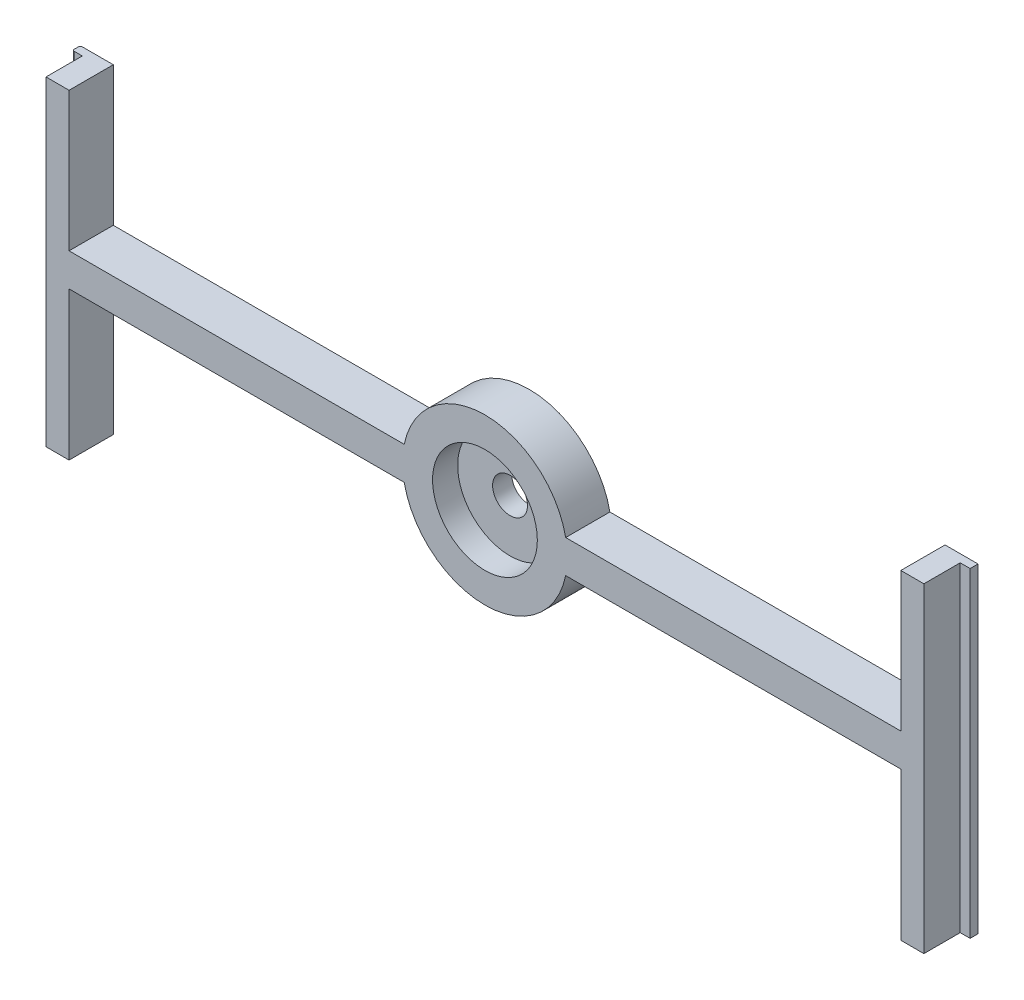
ISO-10303-21;
HEADER;
FILE_DESCRIPTION(('STEP AP214'),'2;1');
FILE_NAME('part.step','',(''),(''),'','','');
FILE_SCHEMA(('AUTOMOTIVE_DESIGN { 1 0 10303 214 1 1 1 1 }'));
ENDSEC;
DATA;
#1=APPLICATION_CONTEXT('core data for automotive mechanical design processes');
#2=APPLICATION_PROTOCOL_DEFINITION('international standard','automotive_design',2000,#1);
#3=PRODUCT_CONTEXT('',#1,'mechanical');
#4=PRODUCT('Part','Part','',(#3));
#5=PRODUCT_RELATED_PRODUCT_CATEGORY('part','',(#4));
#6=PRODUCT_DEFINITION_FORMATION('','',#4);
#7=PRODUCT_DEFINITION_CONTEXT('part definition',#1,'design');
#8=PRODUCT_DEFINITION('design','',#6,#7);
#9=PRODUCT_DEFINITION_SHAPE('','',#8);
#10=(LENGTH_UNIT() NAMED_UNIT(*) SI_UNIT(.MILLI.,.METRE.));
#11=(NAMED_UNIT(*) PLANE_ANGLE_UNIT() SI_UNIT($,.RADIAN.));
#12=(NAMED_UNIT(*) SI_UNIT($,.STERADIAN.) SOLID_ANGLE_UNIT());
#13=UNCERTAINTY_MEASURE_WITH_UNIT(LENGTH_MEASURE(1.E-05),#10,'distance_accuracy_value','');
#14=(GEOMETRIC_REPRESENTATION_CONTEXT(3) GLOBAL_UNCERTAINTY_ASSIGNED_CONTEXT((#13)) GLOBAL_UNIT_ASSIGNED_CONTEXT((#10,
#11,#12)) REPRESENTATION_CONTEXT('',''));
#15=CARTESIAN_POINT('',(0.,0.,0.));
#16=DIRECTION('',(0.,0.,1.));
#17=DIRECTION('',(1.,0.,0.));
#18=AXIS2_PLACEMENT_3D('',#15,#16,#17);
#19=CARTESIAN_POINT('',(-63.1,25.,6.71));
#20=DIRECTION('',(-1.,0.,0.));
#21=DIRECTION('',(0.,-1.,0.));
#22=AXIS2_PLACEMENT_3D('',#19,#20,#21);
#23=PLANE('',#22);
#24=DIRECTION('',(0.,1.,0.));
#25=VECTOR('',#24,1.);
#26=CARTESIAN_POINT('',(-63.1,25.,0.));
#27=LINE('',#26,#25);
#28=CARTESIAN_POINT('',(-63.1,2.50000000000002,0.));
#29=VERTEX_POINT('',#28);
#30=CARTESIAN_POINT('',(-63.1,23.6,0.));
#31=VERTEX_POINT('',#30);
#32=EDGE_CURVE('E326',#29,#31,#27,.T.);
#33=ORIENTED_EDGE('',*,*,#32,.T.);
#34=DIRECTION('',(0.,0.,1.));
#35=VECTOR('',#34,1.);
#36=CARTESIAN_POINT('',(-63.1,23.6,6.71));
#37=LINE('',#36,#35);
#38=CARTESIAN_POINT('',(-63.1,23.6,6.71));
#39=VERTEX_POINT('',#38);
#40=EDGE_CURVE('E395',#31,#39,#37,.T.);
#41=ORIENTED_EDGE('',*,*,#40,.T.);
#42=DIRECTION('',(0.,1.,0.));
#43=VECTOR('',#42,1.);
#44=CARTESIAN_POINT('',(-63.1,25.,6.71));
#45=LINE('',#44,#43);
#46=CARTESIAN_POINT('',(-63.1,2.50000000000002,6.71));
#47=VERTEX_POINT('',#46);
#48=EDGE_CURVE('E238',#47,#39,#45,.T.);
#49=ORIENTED_EDGE('',*,*,#48,.F.);
#50=DIRECTION('',(0.,0.,-1.));
#51=VECTOR('',#50,1.);
#52=CARTESIAN_POINT('',(-63.1,2.50000000000002,6.71));
#53=LINE('',#52,#51);
#54=EDGE_CURVE('E239',#47,#29,#53,.T.);
#55=ORIENTED_EDGE('',*,*,#54,.T.);
#56=EDGE_LOOP('',(#33,#41,#49,#55));
#57=FACE_BOUND('',#56,.T.);
#58=ADVANCED_FACE('F39',(#57),#23,.F.);
#59=CARTESIAN_POINT('',(-68.1,25.,6.71));
#60=DIRECTION('',(1.,0.,0.));
#61=DIRECTION('',(0.,0.,-1.));
#62=AXIS2_PLACEMENT_3D('',#59,#60,#61);
#63=PLANE('',#62);
#64=DIRECTION('',(0.,0.,1.));
#65=VECTOR('',#64,1.);
#66=CARTESIAN_POINT('',(-68.1,23.6,0.));
#67=LINE('',#66,#65);
#68=CARTESIAN_POINT('',(-68.1,23.6,0.3));
#69=VERTEX_POINT('',#68);
#70=CARTESIAN_POINT('',(-68.1,23.6,0.899999999999983));
#71=VERTEX_POINT('',#70);
#72=EDGE_CURVE('E202',#69,#71,#67,.T.);
#73=ORIENTED_EDGE('',*,*,#72,.F.);
#74=DIRECTION('',(0.,-1.,0.));
#75=VECTOR('',#74,1.);
#76=CARTESIAN_POINT('',(-68.1,25.,0.3));
#77=LINE('',#76,#75);
#78=CARTESIAN_POINT('',(-68.1,-25.,0.3));
#79=VERTEX_POINT('',#78);
#80=EDGE_CURVE('E291',#69,#79,#77,.T.);
#81=ORIENTED_EDGE('',*,*,#80,.T.);
#82=DIRECTION('',(0.,0.,-1.));
#83=VECTOR('',#82,1.);
#84=CARTESIAN_POINT('',(-68.1,-25.,6.71));
#85=LINE('',#84,#83);
#86=CARTESIAN_POINT('',(-68.1,-25.,0.899999999999983));
#87=VERTEX_POINT('',#86);
#88=EDGE_CURVE('E282',#87,#79,#85,.T.);
#89=ORIENTED_EDGE('',*,*,#88,.F.);
#90=DIRECTION('',(0.,-1.,0.));
#91=VECTOR('',#90,1.);
#92=CARTESIAN_POINT('',(-68.1,25.,0.899999999999983));
#93=LINE('',#92,#91);
#94=EDGE_CURVE('E288',#87,#71,#93,.F.);
#95=ORIENTED_EDGE('',*,*,#94,.T.);
#96=EDGE_LOOP('',(#73,#81,#89,#95));
#97=FACE_BOUND('',#96,.T.);
#98=ADVANCED_FACE('F312',(#97),#63,.F.);
#99=CARTESIAN_POINT('',(-63.1,-25.,6.71));
#100=DIRECTION('',(0.,1.,0.));
#101=DIRECTION('',(-1.,0.,0.));
#102=AXIS2_PLACEMENT_3D('',#99,#100,#101);
#103=PLANE('',#102);
#104=ORIENTED_EDGE('',*,*,#88,.T.);
#105=CARTESIAN_POINT('',(-67.8,-25.,0.3));
#106=DIRECTION('',(0.,1.,0.));
#107=DIRECTION('',(-1.,0.,0.));
#108=AXIS2_PLACEMENT_3D('',#105,#106,#107);
#109=CIRCLE('',#108,0.3);
#110=CARTESIAN_POINT('',(-67.8,-25.,0.));
#111=VERTEX_POINT('',#110);
#112=EDGE_CURVE('E298',#79,#111,#109,.F.);
#113=ORIENTED_EDGE('',*,*,#112,.T.);
#114=DIRECTION('',(1.,0.,0.));
#115=VECTOR('',#114,1.);
#116=CARTESIAN_POINT('',(-63.1,-25.,0.));
#117=LINE('',#116,#115);
#118=CARTESIAN_POINT('',(-63.1,-25.,0.));
#119=VERTEX_POINT('',#118);
#120=EDGE_CURVE('E321',#111,#119,#117,.T.);
#121=ORIENTED_EDGE('',*,*,#120,.T.);
#122=DIRECTION('',(0.,0.,-1.));
#123=VECTOR('',#122,1.);
#124=CARTESIAN_POINT('',(-63.1,-25.,6.71));
#125=LINE('',#124,#123);
#126=CARTESIAN_POINT('',(-63.1,-25.,6.71));
#127=VERTEX_POINT('',#126);
#128=EDGE_CURVE('E278',#127,#119,#125,.T.);
#129=ORIENTED_EDGE('',*,*,#128,.F.);
#130=DIRECTION('',(1.,0.,0.));
#131=VECTOR('',#130,1.);
#132=CARTESIAN_POINT('',(-63.1,-25.,6.71));
#133=LINE('',#132,#131);
#134=CARTESIAN_POINT('',(-66.6,-25.,6.71));
#135=VERTEX_POINT('',#134);
#136=EDGE_CURVE('E397',#135,#127,#133,.T.);
#137=ORIENTED_EDGE('',*,*,#136,.F.);
#138=DIRECTION('',(0.,0.,1.));
#139=VECTOR('',#138,1.);
#140=CARTESIAN_POINT('',(-66.6,-25.,6.70999999999998));
#141=LINE('',#140,#139);
#142=CARTESIAN_POINT('',(-66.6,-25.,1.19999999999998));
#143=VERTEX_POINT('',#142);
#144=EDGE_CURVE('E434',#143,#135,#141,.T.);
#145=ORIENTED_EDGE('',*,*,#144,.F.);
#146=DIRECTION('',(1.,0.,0.));
#147=VECTOR('',#146,1.);
#148=CARTESIAN_POINT('',(-66.6,-25.,1.19999999999998));
#149=LINE('',#148,#147);
#150=CARTESIAN_POINT('',(-67.8,-25.,1.19999999999998));
#151=VERTEX_POINT('',#150);
#152=EDGE_CURVE('E444',#151,#143,#149,.T.);
#153=ORIENTED_EDGE('',*,*,#152,.F.);
#154=CARTESIAN_POINT('',(-67.8,-25.,0.899999999999983));
#155=DIRECTION('',(0.,1.,0.));
#156=DIRECTION('',(-1.,0.,0.));
#157=AXIS2_PLACEMENT_3D('',#154,#155,#156);
#158=CIRCLE('',#157,0.3);
#159=EDGE_CURVE('E295',#151,#87,#158,.F.);
#160=ORIENTED_EDGE('',*,*,#159,.T.);
#161=EDGE_LOOP('',(#104,#113,#121,#129,#137,#145,#153,#160));
#162=FACE_BOUND('',#161,.T.);
#163=ADVANCED_FACE('F319',(#162),#103,.F.);
#164=CARTESIAN_POINT('',(-63.1,-2.50000000000002,6.71));
#165=DIRECTION('',(-1.,0.,0.));
#166=DIRECTION('',(0.,-1.,0.));
#167=AXIS2_PLACEMENT_3D('',#164,#165,#166);
#168=PLANE('',#167);
#169=DIRECTION('',(0.,1.,0.));
#170=VECTOR('',#169,1.);
#171=CARTESIAN_POINT('',(-63.1,-2.50000000000002,0.));
#172=LINE('',#171,#170);
#173=CARTESIAN_POINT('',(-63.1,-2.50000000000002,0.));
#174=VERTEX_POINT('',#173);
#175=EDGE_CURVE('E324',#119,#174,#172,.T.);
#176=ORIENTED_EDGE('',*,*,#175,.T.);
#177=DIRECTION('',(0.,0.,-1.));
#178=VECTOR('',#177,1.);
#179=CARTESIAN_POINT('',(-63.1,-2.50000000000002,6.71));
#180=LINE('',#179,#178);
#181=CARTESIAN_POINT('',(-63.1,-2.50000000000002,6.71));
#182=VERTEX_POINT('',#181);
#183=EDGE_CURVE('E274',#182,#174,#180,.T.);
#184=ORIENTED_EDGE('',*,*,#183,.F.);
#185=DIRECTION('',(0.,1.,0.));
#186=VECTOR('',#185,1.);
#187=CARTESIAN_POINT('',(-63.1,-2.50000000000002,6.71));
#188=LINE('',#187,#186);
#189=EDGE_CURVE('E400',#127,#182,#188,.T.);
#190=ORIENTED_EDGE('',*,*,#189,.F.);
#191=ORIENTED_EDGE('',*,*,#128,.T.);
#192=EDGE_LOOP('',(#176,#184,#190,#191));
#193=FACE_BOUND('',#192,.T.);
#194=ADVANCED_FACE('F429',(#193),#168,.F.);
#195=CARTESIAN_POINT('',(-63.1,-2.50000000000002,6.71));
#196=DIRECTION('',(0.,1.,0.));
#197=DIRECTION('',(-1.,0.,0.));
#198=AXIS2_PLACEMENT_3D('',#195,#196,#197);
#199=PLANE('',#198);
#200=DIRECTION('',(1.,0.,0.));
#201=VECTOR('',#200,1.);
#202=CARTESIAN_POINT('',(-63.1,-2.50000000000002,0.));
#203=LINE('',#202,#201);
#204=CARTESIAN_POINT('',(-12.2474487139159,-2.50000000000002,0.));
#205=VERTEX_POINT('',#204);
#206=EDGE_CURVE('E330',#174,#205,#203,.T.);
#207=ORIENTED_EDGE('',*,*,#206,.T.);
#208=DIRECTION('',(0.,0.,-1.));
#209=VECTOR('',#208,1.);
#210=CARTESIAN_POINT('',(-12.2474487139159,-2.50000000000002,6.71));
#211=LINE('',#210,#209);
#212=CARTESIAN_POINT('',(-12.2474487139159,-2.50000000000002,6.71));
#213=VERTEX_POINT('',#212);
#214=EDGE_CURVE('E270',#213,#205,#211,.T.);
#215=ORIENTED_EDGE('',*,*,#214,.F.);
#216=DIRECTION('',(1.,0.,0.));
#217=VECTOR('',#216,1.);
#218=CARTESIAN_POINT('',(-63.1,-2.50000000000002,6.71));
#219=LINE('',#218,#217);
#220=EDGE_CURVE('E408',#182,#213,#219,.T.);
#221=ORIENTED_EDGE('',*,*,#220,.F.);
#222=ORIENTED_EDGE('',*,*,#183,.T.);
#223=EDGE_LOOP('',(#207,#215,#221,#222));
#224=FACE_BOUND('',#223,.T.);
#225=ADVANCED_FACE('F425',(#224),#199,.F.);
#226=CARTESIAN_POINT('',(0.,0.,6.71));
#227=DIRECTION('',(0.,0.,-1.));
#228=DIRECTION('',(-1.,0.,0.));
#229=AXIS2_PLACEMENT_3D('',#226,#227,#228);
#230=CYLINDRICAL_SURFACE('',#229,12.5);
#231=CARTESIAN_POINT('',(0.,0.,0.));
#232=DIRECTION('',(0.,0.,1.));
#233=DIRECTION('',(1.,0.,0.));
#234=AXIS2_PLACEMENT_3D('',#231,#232,#233);
#235=CIRCLE('',#234,12.5);
#236=CARTESIAN_POINT('',(12.2474487139159,-2.50000000000002,0.));
#237=VERTEX_POINT('',#236);
#238=EDGE_CURVE('E339',#205,#237,#235,.T.);
#239=ORIENTED_EDGE('',*,*,#238,.T.);
#240=DIRECTION('',(0.,0.,-1.));
#241=VECTOR('',#240,1.);
#242=CARTESIAN_POINT('',(12.2474487139159,-2.50000000000002,6.71));
#243=LINE('',#242,#241);
#244=CARTESIAN_POINT('',(12.2474487139159,-2.50000000000002,6.71));
#245=VERTEX_POINT('',#244);
#246=EDGE_CURVE('E266',#245,#237,#243,.T.);
#247=ORIENTED_EDGE('',*,*,#246,.F.);
#248=CARTESIAN_POINT('',(0.,0.,6.71));
#249=DIRECTION('',(0.,0.,1.));
#250=DIRECTION('',(1.,0.,0.));
#251=AXIS2_PLACEMENT_3D('',#248,#249,#250);
#252=CIRCLE('',#251,12.5);
#253=EDGE_CURVE('E411',#213,#245,#252,.T.);
#254=ORIENTED_EDGE('',*,*,#253,.F.);
#255=ORIENTED_EDGE('',*,*,#214,.T.);
#256=EDGE_LOOP('',(#239,#247,#254,#255));
#257=FACE_BOUND('',#256,.T.);
#258=ADVANCED_FACE('F421',(#257),#230,.T.);
#259=CARTESIAN_POINT('',(12.2474487139159,-2.50000000000002,6.71));
#260=DIRECTION('',(0.,1.,0.));
#261=DIRECTION('',(-1.,0.,0.));
#262=AXIS2_PLACEMENT_3D('',#259,#260,#261);
#263=PLANE('',#262);
#264=DIRECTION('',(1.,0.,0.));
#265=VECTOR('',#264,1.);
#266=CARTESIAN_POINT('',(12.2474487139159,-2.50000000000002,0.));
#267=LINE('',#266,#265);
#268=CARTESIAN_POINT('',(63.1,-2.5,0.));
#269=VERTEX_POINT('',#268);
#270=EDGE_CURVE('E342',#237,#269,#267,.T.);
#271=ORIENTED_EDGE('',*,*,#270,.T.);
#272=DIRECTION('',(0.,0.,-1.));
#273=VECTOR('',#272,1.);
#274=CARTESIAN_POINT('',(63.1,-2.5,6.71));
#275=LINE('',#274,#273);
#276=CARTESIAN_POINT('',(63.1,-2.5,6.71));
#277=VERTEX_POINT('',#276);
#278=EDGE_CURVE('E262',#277,#269,#275,.T.);
#279=ORIENTED_EDGE('',*,*,#278,.F.);
#280=DIRECTION('',(1.,0.,0.));
#281=VECTOR('',#280,1.);
#282=CARTESIAN_POINT('',(12.2474487139159,-2.50000000000002,6.71));
#283=LINE('',#282,#281);
#284=EDGE_CURVE('E371',#245,#277,#283,.T.);
#285=ORIENTED_EDGE('',*,*,#284,.F.);
#286=ORIENTED_EDGE('',*,*,#246,.T.);
#287=EDGE_LOOP('',(#271,#279,#285,#286));
#288=FACE_BOUND('',#287,.T.);
#289=ADVANCED_FACE('F418',(#288),#263,.F.);
#290=CARTESIAN_POINT('',(63.1,-2.5,6.71));
#291=DIRECTION('',(1.,0.,0.));
#292=DIRECTION('',(0.,1.,0.));
#293=AXIS2_PLACEMENT_3D('',#290,#291,#292);
#294=PLANE('',#293);
#295=DIRECTION('',(0.,-1.,0.));
#296=VECTOR('',#295,1.);
#297=CARTESIAN_POINT('',(63.1,-2.5,0.));
#298=LINE('',#297,#296);
#299=CARTESIAN_POINT('',(63.1,-25.,0.));
#300=VERTEX_POINT('',#299);
#301=EDGE_CURVE('E226',#269,#300,#298,.T.);
#302=ORIENTED_EDGE('',*,*,#301,.T.);
#303=DIRECTION('',(0.,0.,-1.));
#304=VECTOR('',#303,1.);
#305=CARTESIAN_POINT('',(63.1,-25.,6.71));
#306=LINE('',#305,#304);
#307=CARTESIAN_POINT('',(63.1,-25.,6.71));
#308=VERTEX_POINT('',#307);
#309=EDGE_CURVE('E258',#308,#300,#306,.T.);
#310=ORIENTED_EDGE('',*,*,#309,.F.);
#311=DIRECTION('',(0.,-1.,0.));
#312=VECTOR('',#311,1.);
#313=CARTESIAN_POINT('',(63.1,-2.5,6.71));
#314=LINE('',#313,#312);
#315=EDGE_CURVE('E365',#277,#308,#314,.T.);
#316=ORIENTED_EDGE('',*,*,#315,.F.);
#317=ORIENTED_EDGE('',*,*,#278,.T.);
#318=EDGE_LOOP('',(#302,#310,#316,#317));
#319=FACE_BOUND('',#318,.T.);
#320=ADVANCED_FACE('F348',(#319),#294,.F.);
#321=CARTESIAN_POINT('',(63.1,-25.,6.71));
#322=DIRECTION('',(0.,1.,0.));
#323=DIRECTION('',(0.,0.,1.));
#324=AXIS2_PLACEMENT_3D('',#321,#322,#323);
#325=PLANE('',#324);
#326=DIRECTION('',(1.,0.,0.));
#327=VECTOR('',#326,1.);
#328=CARTESIAN_POINT('',(66.6,-25.,1.2));
#329=LINE('',#328,#327);
#330=CARTESIAN_POINT('',(66.6,-25.,1.2));
#331=VERTEX_POINT('',#330);
#332=CARTESIAN_POINT('',(68.1,-25.,1.2));
#333=VERTEX_POINT('',#332);
#334=EDGE_CURVE('E455',#331,#333,#329,.T.);
#335=ORIENTED_EDGE('',*,*,#334,.F.);
#336=DIRECTION('',(0.,0.,-1.));
#337=VECTOR('',#336,1.);
#338=CARTESIAN_POINT('',(66.6,-25.,6.71));
#339=LINE('',#338,#337);
#340=CARTESIAN_POINT('',(66.6,-25.,6.71));
#341=VERTEX_POINT('',#340);
#342=EDGE_CURVE('E360',#341,#331,#339,.T.);
#343=ORIENTED_EDGE('',*,*,#342,.F.);
#344=DIRECTION('',(1.,0.,0.));
#345=VECTOR('',#344,1.);
#346=CARTESIAN_POINT('',(63.1,-25.,6.71));
#347=LINE('',#346,#345);
#348=EDGE_CURVE('E358',#308,#341,#347,.T.);
#349=ORIENTED_EDGE('',*,*,#348,.F.);
#350=ORIENTED_EDGE('',*,*,#309,.T.);
#351=DIRECTION('',(1.,0.,0.));
#352=VECTOR('',#351,1.);
#353=CARTESIAN_POINT('',(63.1,-25.,0.));
#354=LINE('',#353,#352);
#355=CARTESIAN_POINT('',(68.1,-25.,0.));
#356=VERTEX_POINT('',#355);
#357=EDGE_CURVE('E220',#300,#356,#354,.T.);
#358=ORIENTED_EDGE('',*,*,#357,.T.);
#359=DIRECTION('',(0.,0.,-1.));
#360=VECTOR('',#359,1.);
#361=CARTESIAN_POINT('',(68.1,-25.,6.71));
#362=LINE('',#361,#360);
#363=EDGE_CURVE('E217',#333,#356,#362,.T.);
#364=ORIENTED_EDGE('',*,*,#363,.F.);
#365=EDGE_LOOP('',(#335,#343,#349,#350,#358,#364));
#366=FACE_BOUND('',#365,.T.);
#367=ADVANCED_FACE('F355',(#366),#325,.F.);
#368=CARTESIAN_POINT('',(68.1,25.,6.71));
#369=DIRECTION('',(-1.,0.,0.));
#370=DIRECTION('',(0.,0.,1.));
#371=AXIS2_PLACEMENT_3D('',#368,#369,#370);
#372=PLANE('',#371);
#373=DIRECTION('',(0.,1.,0.));
#374=VECTOR('',#373,1.);
#375=CARTESIAN_POINT('',(68.1,25.,0.));
#376=LINE('',#375,#374);
#377=CARTESIAN_POINT('',(68.1,23.6,0.));
#378=VERTEX_POINT('',#377);
#379=EDGE_CURVE('E208',#356,#378,#376,.T.);
#380=ORIENTED_EDGE('',*,*,#379,.T.);
#381=DIRECTION('',(0.,0.,1.));
#382=VECTOR('',#381,1.);
#383=CARTESIAN_POINT('',(68.1,23.6,0.));
#384=LINE('',#383,#382);
#385=CARTESIAN_POINT('',(68.1,23.6,1.2));
#386=VERTEX_POINT('',#385);
#387=EDGE_CURVE('E190',#378,#386,#384,.T.);
#388=ORIENTED_EDGE('',*,*,#387,.T.);
#389=DIRECTION('',(0.,-1.,0.));
#390=VECTOR('',#389,1.);
#391=CARTESIAN_POINT('',(68.1,25.,1.2));
#392=LINE('',#391,#390);
#393=EDGE_CURVE('E454',#386,#333,#392,.T.);
#394=ORIENTED_EDGE('',*,*,#393,.T.);
#395=ORIENTED_EDGE('',*,*,#363,.T.);
#396=EDGE_LOOP('',(#380,#388,#394,#395));
#397=FACE_BOUND('',#396,.T.);
#398=ADVANCED_FACE('F215',(#397),#372,.F.);
#399=CARTESIAN_POINT('',(63.1,25.,6.71));
#400=DIRECTION('',(1.,0.,0.));
#401=DIRECTION('',(0.,1.,0.));
#402=AXIS2_PLACEMENT_3D('',#399,#400,#401);
#403=PLANE('',#402);
#404=DIRECTION('',(0.,-1.,0.));
#405=VECTOR('',#404,1.);
#406=CARTESIAN_POINT('',(63.1,25.,6.71));
#407=LINE('',#406,#405);
#408=CARTESIAN_POINT('',(63.1,23.6,6.71));
#409=VERTEX_POINT('',#408);
#410=CARTESIAN_POINT('',(63.1,2.5,6.71));
#411=VERTEX_POINT('',#410);
#412=EDGE_CURVE('E364',#409,#411,#407,.T.);
#413=ORIENTED_EDGE('',*,*,#412,.F.);
#414=DIRECTION('',(0.,0.,-1.));
#415=VECTOR('',#414,1.);
#416=CARTESIAN_POINT('',(63.1,23.6,6.71));
#417=LINE('',#416,#415);
#418=CARTESIAN_POINT('',(63.1,23.6,0.));
#419=VERTEX_POINT('',#418);
#420=EDGE_CURVE('E474',#409,#419,#417,.T.);
#421=ORIENTED_EDGE('',*,*,#420,.T.);
#422=DIRECTION('',(0.,-1.,0.));
#423=VECTOR('',#422,1.);
#424=CARTESIAN_POINT('',(63.1,25.,0.));
#425=LINE('',#424,#423);
#426=CARTESIAN_POINT('',(63.1,2.5,0.));
#427=VERTEX_POINT('',#426);
#428=EDGE_CURVE('E210',#419,#427,#425,.T.);
#429=ORIENTED_EDGE('',*,*,#428,.T.);
#430=DIRECTION('',(0.,0.,-1.));
#431=VECTOR('',#430,1.);
#432=CARTESIAN_POINT('',(63.1,2.5,6.71));
#433=LINE('',#432,#431);
#434=EDGE_CURVE('E252',#411,#427,#433,.T.);
#435=ORIENTED_EDGE('',*,*,#434,.F.);
#436=EDGE_LOOP('',(#413,#421,#429,#435));
#437=FACE_BOUND('',#436,.T.);
#438=ADVANCED_FACE('F555',(#437),#403,.F.);
#439=CARTESIAN_POINT('',(12.2474487139159,2.50000000000002,6.71));
#440=DIRECTION('',(0.,-1.,0.));
#441=DIRECTION('',(1.,0.,0.));
#442=AXIS2_PLACEMENT_3D('',#439,#440,#441);
#443=PLANE('',#442);
#444=DIRECTION('',(-1.,0.,0.));
#445=VECTOR('',#444,1.);
#446=CARTESIAN_POINT('',(12.2474487139159,2.50000000000002,0.));
#447=LINE('',#446,#445);
#448=CARTESIAN_POINT('',(12.2474487139159,2.50000000000002,0.));
#449=VERTEX_POINT('',#448);
#450=EDGE_CURVE('E224',#427,#449,#447,.T.);
#451=ORIENTED_EDGE('',*,*,#450,.T.);
#452=DIRECTION('',(0.,0.,-1.));
#453=VECTOR('',#452,1.);
#454=CARTESIAN_POINT('',(12.2474487139159,2.50000000000002,6.71));
#455=LINE('',#454,#453);
#456=CARTESIAN_POINT('',(12.2474487139159,2.50000000000002,6.71));
#457=VERTEX_POINT('',#456);
#458=EDGE_CURVE('E248',#457,#449,#455,.T.);
#459=ORIENTED_EDGE('',*,*,#458,.F.);
#460=DIRECTION('',(-1.,0.,0.));
#461=VECTOR('',#460,1.);
#462=CARTESIAN_POINT('',(12.2474487139159,2.50000000000002,6.71));
#463=LINE('',#462,#461);
#464=EDGE_CURVE('E369',#411,#457,#463,.T.);
#465=ORIENTED_EDGE('',*,*,#464,.F.);
#466=ORIENTED_EDGE('',*,*,#434,.T.);
#467=EDGE_LOOP('',(#451,#459,#465,#466));
#468=FACE_BOUND('',#467,.T.);
#469=ADVANCED_FACE('F551',(#468),#443,.F.);
#470=CARTESIAN_POINT('',(0.,0.,6.71));
#471=DIRECTION('',(0.,0.,-1.));
#472=DIRECTION('',(-1.,0.,0.));
#473=AXIS2_PLACEMENT_3D('',#470,#471,#472);
#474=CYLINDRICAL_SURFACE('',#473,12.5);
#475=CARTESIAN_POINT('',(0.,0.,0.));
#476=DIRECTION('',(0.,0.,1.));
#477=DIRECTION('',(1.,0.,0.));
#478=AXIS2_PLACEMENT_3D('',#475,#476,#477);
#479=CIRCLE('',#478,12.5);
#480=CARTESIAN_POINT('',(-12.2474487139159,2.50000000000002,0.));
#481=VERTEX_POINT('',#480);
#482=EDGE_CURVE('E232',#449,#481,#479,.T.);
#483=ORIENTED_EDGE('',*,*,#482,.T.);
#484=DIRECTION('',(0.,0.,-1.));
#485=VECTOR('',#484,1.);
#486=CARTESIAN_POINT('',(-12.2474487139159,2.50000000000002,6.71));
#487=LINE('',#486,#485);
#488=CARTESIAN_POINT('',(-12.2474487139159,2.50000000000002,6.71));
#489=VERTEX_POINT('',#488);
#490=EDGE_CURVE('E243',#489,#481,#487,.T.);
#491=ORIENTED_EDGE('',*,*,#490,.F.);
#492=CARTESIAN_POINT('',(0.,0.,6.71));
#493=DIRECTION('',(0.,0.,1.));
#494=DIRECTION('',(1.,0.,0.));
#495=AXIS2_PLACEMENT_3D('',#492,#493,#494);
#496=CIRCLE('',#495,12.5);
#497=EDGE_CURVE('E377',#457,#489,#496,.T.);
#498=ORIENTED_EDGE('',*,*,#497,.F.);
#499=ORIENTED_EDGE('',*,*,#458,.T.);
#500=EDGE_LOOP('',(#483,#491,#498,#499));
#501=FACE_BOUND('',#500,.T.);
#502=ADVANCED_FACE('F525',(#501),#474,.T.);
#503=CARTESIAN_POINT('',(-63.1,2.50000000000002,6.71));
#504=DIRECTION('',(0.,-1.,0.));
#505=DIRECTION('',(1.,0.,0.));
#506=AXIS2_PLACEMENT_3D('',#503,#504,#505);
#507=PLANE('',#506);
#508=DIRECTION('',(-1.,0.,0.));
#509=VECTOR('',#508,1.);
#510=CARTESIAN_POINT('',(-63.1,2.50000000000002,0.));
#511=LINE('',#510,#509);
#512=EDGE_CURVE('E235',#481,#29,#511,.T.);
#513=ORIENTED_EDGE('',*,*,#512,.T.);
#514=ORIENTED_EDGE('',*,*,#54,.F.);
#515=DIRECTION('',(-1.,0.,0.));
#516=VECTOR('',#515,1.);
#517=CARTESIAN_POINT('',(-63.1,2.50000000000002,6.71));
#518=LINE('',#517,#516);
#519=EDGE_CURVE('E244',#489,#47,#518,.T.);
#520=ORIENTED_EDGE('',*,*,#519,.F.);
#521=ORIENTED_EDGE('',*,*,#490,.T.);
#522=EDGE_LOOP('',(#513,#514,#520,#521));
#523=FACE_BOUND('',#522,.T.);
#524=ADVANCED_FACE('F390',(#523),#507,.F.);
#525=CARTESIAN_POINT('',(0.,0.,6.71));
#526=DIRECTION('',(0.,0.,1.));
#527=DIRECTION('',(1.,0.,0.));
#528=AXIS2_PLACEMENT_3D('',#525,#526,#527);
#529=PLANE('',#528);
#530=DIRECTION('',(1.,0.,0.));
#531=VECTOR('',#530,1.);
#532=CARTESIAN_POINT('',(-68.1,23.6,6.71));
#533=LINE('',#532,#531);
#534=CARTESIAN_POINT('',(-66.6,23.6,6.71));
#535=VERTEX_POINT('',#534);
#536=EDGE_CURVE('E213',#535,#39,#533,.T.);
#537=ORIENTED_EDGE('',*,*,#536,.F.);
#538=DIRECTION('',(0.,-1.,0.));
#539=VECTOR('',#538,1.);
#540=CARTESIAN_POINT('',(-66.6,25.,6.70999999999998));
#541=LINE('',#540,#539);
#542=EDGE_CURVE('E436',#535,#135,#541,.T.);
#543=ORIENTED_EDGE('',*,*,#542,.T.);
#544=ORIENTED_EDGE('',*,*,#136,.T.);
#545=ORIENTED_EDGE('',*,*,#189,.T.);
#546=ORIENTED_EDGE('',*,*,#220,.T.);
#547=ORIENTED_EDGE('',*,*,#253,.T.);
#548=ORIENTED_EDGE('',*,*,#284,.T.);
#549=ORIENTED_EDGE('',*,*,#315,.T.);
#550=ORIENTED_EDGE('',*,*,#348,.T.);
#551=DIRECTION('',(0.,-1.,0.));
#552=VECTOR('',#551,1.);
#553=CARTESIAN_POINT('',(66.6,25.,6.71));
#554=LINE('',#553,#552);
#555=CARTESIAN_POINT('',(66.6,23.6,6.71));
#556=VERTEX_POINT('',#555);
#557=EDGE_CURVE('E333',#556,#341,#554,.T.);
#558=ORIENTED_EDGE('',*,*,#557,.F.);
#559=EDGE_CURVE('E486',#409,#556,#533,.T.);
#560=ORIENTED_EDGE('',*,*,#559,.F.);
#561=ORIENTED_EDGE('',*,*,#412,.T.);
#562=ORIENTED_EDGE('',*,*,#464,.T.);
#563=ORIENTED_EDGE('',*,*,#497,.T.);
#564=ORIENTED_EDGE('',*,*,#519,.T.);
#565=ORIENTED_EDGE('',*,*,#48,.T.);
#566=EDGE_LOOP('',(#537,#543,#544,#545,#546,#547,#548,#549,#550,#558,#560,#561,#562,#563,#564,#565));
#567=FACE_BOUND('',#566,.T.);
#568=CARTESIAN_POINT('',(0.,0.,6.71));
#569=DIRECTION('',(0.,0.,1.));
#570=DIRECTION('',(1.,0.,0.));
#571=AXIS2_PLACEMENT_3D('',#568,#569,#570);
#572=CIRCLE('',#571,7.9502);
#573=CARTESIAN_POINT('',(7.9502,0.,6.71));
#574=VERTEX_POINT('',#573);
#575=EDGE_CURVE('E465',#574,#574,#572,.T.);
#576=ORIENTED_EDGE('',*,*,#575,.F.);
#577=EDGE_LOOP('',(#576));
#578=FACE_BOUND('',#577,.T.);
#579=ADVANCED_FACE('F384',(#567,#578),#529,.T.);
#580=CARTESIAN_POINT('',(0.,0.,0.));
#581=DIRECTION('',(0.,0.,1.));
#582=DIRECTION('',(1.,0.,0.));
#583=AXIS2_PLACEMENT_3D('',#580,#581,#582);
#584=PLANE('',#583);
#585=CARTESIAN_POINT('',(0.,0.,0.));
#586=DIRECTION('',(0.,0.,1.));
#587=DIRECTION('',(1.,0.,0.));
#588=AXIS2_PLACEMENT_3D('',#585,#586,#587);
#589=CIRCLE('',#588,2.65);
#590=CARTESIAN_POINT('',(2.65,0.,0.));
#591=VERTEX_POINT('',#590);
#592=EDGE_CURVE('E488',#591,#591,#589,.T.);
#593=ORIENTED_EDGE('',*,*,#592,.T.);
#594=EDGE_LOOP('',(#593));
#595=FACE_BOUND('',#594,.T.);
#596=ORIENTED_EDGE('',*,*,#120,.F.);
#597=DIRECTION('',(0.,-1.,0.));
#598=VECTOR('',#597,1.);
#599=CARTESIAN_POINT('',(-67.8,0.,0.));
#600=LINE('',#599,#598);
#601=CARTESIAN_POINT('',(-67.8,23.6,0.));
#602=VERTEX_POINT('',#601);
#603=EDGE_CURVE('E63',#111,#602,#600,.F.);
#604=ORIENTED_EDGE('',*,*,#603,.T.);
#605=DIRECTION('',(1.,0.,0.));
#606=VECTOR('',#605,1.);
#607=CARTESIAN_POINT('',(-68.1,23.6,0.));
#608=LINE('',#607,#606);
#609=EDGE_CURVE('E212',#602,#31,#608,.T.);
#610=ORIENTED_EDGE('',*,*,#609,.T.);
#611=ORIENTED_EDGE('',*,*,#32,.F.);
#612=ORIENTED_EDGE('',*,*,#512,.F.);
#613=ORIENTED_EDGE('',*,*,#482,.F.);
#614=ORIENTED_EDGE('',*,*,#450,.F.);
#615=ORIENTED_EDGE('',*,*,#428,.F.);
#616=EDGE_CURVE('E193',#419,#378,#608,.T.);
#617=ORIENTED_EDGE('',*,*,#616,.T.);
#618=ORIENTED_EDGE('',*,*,#379,.F.);
#619=ORIENTED_EDGE('',*,*,#357,.F.);
#620=ORIENTED_EDGE('',*,*,#301,.F.);
#621=ORIENTED_EDGE('',*,*,#270,.F.);
#622=ORIENTED_EDGE('',*,*,#238,.F.);
#623=ORIENTED_EDGE('',*,*,#206,.F.);
#624=ORIENTED_EDGE('',*,*,#175,.F.);
#625=EDGE_LOOP('',(#596,#604,#610,#611,#612,#613,#614,#615,#617,#618,#619,#620,#621,#622,#623,#624));
#626=FACE_BOUND('',#625,.T.);
#627=ADVANCED_FACE('F206',(#595,#626),#584,.F.);
#628=CARTESIAN_POINT('',(-66.6,25.,6.70999999999998));
#629=DIRECTION('',(1.,0.,0.));
#630=DIRECTION('',(0.,0.,-1.));
#631=AXIS2_PLACEMENT_3D('',#628,#629,#630);
#632=PLANE('',#631);
#633=ORIENTED_EDGE('',*,*,#542,.F.);
#634=DIRECTION('',(0.,0.,-1.));
#635=VECTOR('',#634,1.);
#636=CARTESIAN_POINT('',(-66.6,23.6,6.70999999999998));
#637=LINE('',#636,#635);
#638=CARTESIAN_POINT('',(-66.6,23.6,1.19999999999998));
#639=VERTEX_POINT('',#638);
#640=EDGE_CURVE('E477',#535,#639,#637,.T.);
#641=ORIENTED_EDGE('',*,*,#640,.T.);
#642=DIRECTION('',(0.,-1.,0.));
#643=VECTOR('',#642,1.);
#644=CARTESIAN_POINT('',(-66.6,25.,1.19999999999998));
#645=LINE('',#644,#643);
#646=EDGE_CURVE('E403',#639,#143,#645,.T.);
#647=ORIENTED_EDGE('',*,*,#646,.T.);
#648=ORIENTED_EDGE('',*,*,#144,.T.);
#649=EDGE_LOOP('',(#633,#641,#647,#648));
#650=FACE_BOUND('',#649,.T.);
#651=ADVANCED_FACE('F441',(#650),#632,.F.);
#652=CARTESIAN_POINT('',(-66.6,25.,1.19999999999998));
#653=DIRECTION('',(0.,0.,-1.));
#654=DIRECTION('',(-1.,0.,0.));
#655=AXIS2_PLACEMENT_3D('',#652,#653,#654);
#656=PLANE('',#655);
#657=DIRECTION('',(-1.,0.,0.));
#658=VECTOR('',#657,1.);
#659=CARTESIAN_POINT('',(-66.6,23.6,1.19999999999998));
#660=LINE('',#659,#658);
#661=CARTESIAN_POINT('',(-67.8,23.6,1.19999999999998));
#662=VERTEX_POINT('',#661);
#663=EDGE_CURVE('E480',#639,#662,#660,.T.);
#664=ORIENTED_EDGE('',*,*,#663,.T.);
#665=DIRECTION('',(0.,-1.,0.));
#666=VECTOR('',#665,1.);
#667=CARTESIAN_POINT('',(-67.8,25.,1.19999999999998));
#668=LINE('',#667,#666);
#669=EDGE_CURVE('E11',#662,#151,#668,.T.);
#670=ORIENTED_EDGE('',*,*,#669,.T.);
#671=ORIENTED_EDGE('',*,*,#152,.T.);
#672=ORIENTED_EDGE('',*,*,#646,.F.);
#673=EDGE_LOOP('',(#664,#670,#671,#672));
#674=FACE_BOUND('',#673,.T.);
#675=ADVANCED_FACE('F544',(#674),#656,.F.);
#676=CARTESIAN_POINT('',(66.6,25.,6.71));
#677=DIRECTION('',(-1.,0.,0.));
#678=DIRECTION('',(0.,0.,1.));
#679=AXIS2_PLACEMENT_3D('',#676,#677,#678);
#680=PLANE('',#679);
#681=DIRECTION('',(0.,-1.,0.));
#682=VECTOR('',#681,1.);
#683=CARTESIAN_POINT('',(66.6,25.,1.2));
#684=LINE('',#683,#682);
#685=CARTESIAN_POINT('',(66.6,23.6,1.2));
#686=VERTEX_POINT('',#685);
#687=EDGE_CURVE('E451',#686,#331,#684,.T.);
#688=ORIENTED_EDGE('',*,*,#687,.F.);
#689=DIRECTION('',(0.,0.,1.));
#690=VECTOR('',#689,1.);
#691=CARTESIAN_POINT('',(66.6,23.6,6.71));
#692=LINE('',#691,#690);
#693=EDGE_CURVE('E201',#686,#556,#692,.T.);
#694=ORIENTED_EDGE('',*,*,#693,.T.);
#695=ORIENTED_EDGE('',*,*,#557,.T.);
#696=ORIENTED_EDGE('',*,*,#342,.T.);
#697=EDGE_LOOP('',(#688,#694,#695,#696));
#698=FACE_BOUND('',#697,.T.);
#699=ADVANCED_FACE('F559',(#698),#680,.F.);
#700=CARTESIAN_POINT('',(66.6,25.,1.2));
#701=DIRECTION('',(0.,0.,-1.));
#702=DIRECTION('',(-1.,0.,0.));
#703=AXIS2_PLACEMENT_3D('',#700,#701,#702);
#704=PLANE('',#703);
#705=ORIENTED_EDGE('',*,*,#393,.F.);
#706=DIRECTION('',(-1.,0.,0.));
#707=VECTOR('',#706,1.);
#708=CARTESIAN_POINT('',(66.6,23.6,1.2));
#709=LINE('',#708,#707);
#710=EDGE_CURVE('E196',#386,#686,#709,.T.);
#711=ORIENTED_EDGE('',*,*,#710,.T.);
#712=ORIENTED_EDGE('',*,*,#687,.T.);
#713=ORIENTED_EDGE('',*,*,#334,.T.);
#714=EDGE_LOOP('',(#705,#711,#712,#713));
#715=FACE_BOUND('',#714,.T.);
#716=ADVANCED_FACE('F515',(#715),#704,.F.);
#717=CARTESIAN_POINT('',(0.,0.,2.9));
#718=DIRECTION('',(0.,0.,1.));
#719=DIRECTION('',(1.,0.,0.));
#720=AXIS2_PLACEMENT_3D('',#717,#718,#719);
#721=CYLINDRICAL_SURFACE('',#720,7.9502);
#722=CARTESIAN_POINT('',(0.,0.,2.9));
#723=DIRECTION('',(0.,0.,1.));
#724=DIRECTION('',(1.,0.,0.));
#725=AXIS2_PLACEMENT_3D('',#722,#723,#724);
#726=CIRCLE('',#725,7.9502);
#727=CARTESIAN_POINT('',(7.9502,0.,2.9));
#728=VERTEX_POINT('',#727);
#729=EDGE_CURVE('E448',#728,#728,#726,.T.);
#730=ORIENTED_EDGE('',*,*,#729,.F.);
#731=EDGE_LOOP('',(#730));
#732=FACE_BOUND('',#731,.T.);
#733=ORIENTED_EDGE('',*,*,#575,.T.);
#734=EDGE_LOOP('',(#733));
#735=FACE_BOUND('',#734,.T.);
#736=ADVANCED_FACE('F509',(#732,#735),#721,.F.);
#737=CARTESIAN_POINT('',(0.,0.,2.9));
#738=DIRECTION('',(0.,0.,1.));
#739=DIRECTION('',(1.,0.,0.));
#740=AXIS2_PLACEMENT_3D('',#737,#738,#739);
#741=PLANE('',#740);
#742=CARTESIAN_POINT('',(0.,0.,2.9));
#743=DIRECTION('',(0.,0.,1.));
#744=DIRECTION('',(1.,0.,0.));
#745=AXIS2_PLACEMENT_3D('',#742,#743,#744);
#746=CIRCLE('',#745,2.65);
#747=CARTESIAN_POINT('',(2.65,0.,2.9));
#748=VERTEX_POINT('',#747);
#749=EDGE_CURVE('E491',#748,#748,#746,.T.);
#750=ORIENTED_EDGE('',*,*,#749,.F.);
#751=EDGE_LOOP('',(#750));
#752=FACE_BOUND('',#751,.T.);
#753=ORIENTED_EDGE('',*,*,#729,.T.);
#754=EDGE_LOOP('',(#753));
#755=FACE_BOUND('',#754,.T.);
#756=ADVANCED_FACE('F506',(#752,#755),#741,.T.);
#757=CARTESIAN_POINT('',(-68.1,23.6,0.));
#758=DIRECTION('',(0.,-1.,0.));
#759=DIRECTION('',(0.,0.,-1.));
#760=AXIS2_PLACEMENT_3D('',#757,#758,#759);
#761=PLANE('',#760);
#762=ORIENTED_EDGE('',*,*,#559,.T.);
#763=ORIENTED_EDGE('',*,*,#693,.F.);
#764=ORIENTED_EDGE('',*,*,#710,.F.);
#765=ORIENTED_EDGE('',*,*,#387,.F.);
#766=ORIENTED_EDGE('',*,*,#616,.F.);
#767=ORIENTED_EDGE('',*,*,#420,.F.);
#768=EDGE_LOOP('',(#762,#763,#764,#765,#766,#767));
#769=FACE_BOUND('',#768,.T.);
#770=ADVANCED_FACE('F192',(#769),#761,.F.);
#771=ORIENTED_EDGE('',*,*,#609,.F.);
#772=CARTESIAN_POINT('',(-67.8,23.6,0.3));
#773=DIRECTION('',(0.,-1.,0.));
#774=DIRECTION('',(0.,0.,-1.));
#775=AXIS2_PLACEMENT_3D('',#772,#773,#774);
#776=CIRCLE('',#775,0.3);
#777=EDGE_CURVE('E48',#602,#69,#776,.F.);
#778=ORIENTED_EDGE('',*,*,#777,.T.);
#779=ORIENTED_EDGE('',*,*,#72,.T.);
#780=CARTESIAN_POINT('',(-67.8,23.6,0.899999999999983));
#781=DIRECTION('',(0.,-1.,0.));
#782=DIRECTION('',(0.,0.,-1.));
#783=AXIS2_PLACEMENT_3D('',#780,#781,#782);
#784=CIRCLE('',#783,0.3);
#785=EDGE_CURVE('E55',#71,#662,#784,.F.);
#786=ORIENTED_EDGE('',*,*,#785,.T.);
#787=ORIENTED_EDGE('',*,*,#663,.F.);
#788=ORIENTED_EDGE('',*,*,#640,.F.);
#789=ORIENTED_EDGE('',*,*,#536,.T.);
#790=ORIENTED_EDGE('',*,*,#40,.F.);
#791=EDGE_LOOP('',(#771,#778,#779,#786,#787,#788,#789,#790));
#792=FACE_BOUND('',#791,.T.);
#793=ADVANCED_FACE('F307',(#792),#761,.F.);
#794=CARTESIAN_POINT('',(0.,0.,0.));
#795=DIRECTION('',(0.,0.,1.));
#796=DIRECTION('',(1.,0.,0.));
#797=AXIS2_PLACEMENT_3D('',#794,#795,#796);
#798=CYLINDRICAL_SURFACE('',#797,2.65);
#799=ORIENTED_EDGE('',*,*,#592,.F.);
#800=EDGE_LOOP('',(#799));
#801=FACE_BOUND('',#800,.T.);
#802=ORIENTED_EDGE('',*,*,#749,.T.);
#803=EDGE_LOOP('',(#802));
#804=FACE_BOUND('',#803,.T.);
#805=ADVANCED_FACE('F500',(#801,#804),#798,.F.);
#806=CARTESIAN_POINT('',(-67.8,25.,0.3));
#807=DIRECTION('',(0.,-1.,0.));
#808=DIRECTION('',(0.,0.,-1.));
#809=AXIS2_PLACEMENT_3D('',#806,#807,#808);
#810=CYLINDRICAL_SURFACE('',#809,0.3);
#811=ORIENTED_EDGE('',*,*,#777,.F.);
#812=ORIENTED_EDGE('',*,*,#603,.F.);
#813=ORIENTED_EDGE('',*,*,#112,.F.);
#814=ORIENTED_EDGE('',*,*,#80,.F.);
#815=EDGE_LOOP('',(#811,#812,#813,#814));
#816=FACE_BOUND('',#815,.T.);
#817=ADVANCED_FACE('F317',(#816),#810,.T.);
#818=CARTESIAN_POINT('',(-67.8,25.,0.899999999999983));
#819=DIRECTION('',(0.,-1.,0.));
#820=DIRECTION('',(0.,0.,-1.));
#821=AXIS2_PLACEMENT_3D('',#818,#819,#820);
#822=CYLINDRICAL_SURFACE('',#821,0.3);
#823=ORIENTED_EDGE('',*,*,#785,.F.);
#824=ORIENTED_EDGE('',*,*,#94,.F.);
#825=ORIENTED_EDGE('',*,*,#159,.F.);
#826=ORIENTED_EDGE('',*,*,#669,.F.);
#827=EDGE_LOOP('',(#823,#824,#825,#826));
#828=FACE_BOUND('',#827,.T.);
#829=ADVANCED_FACE('F41',(#828),#822,.T.);
#830=CLOSED_SHELL('',(#58,#98,#163,#194,#225,#258,#289,#320,#367,#398,#438,#469,#502,#524,#579,
#627,#651,#675,#699,#716,#736,#756,#770,#793,#805,#817,#829));
#831=MANIFOLD_SOLID_BREP('B2',#830);
#832=ADVANCED_BREP_SHAPE_REPRESENTATION('',(#18,#831),#14);
#833=SHAPE_DEFINITION_REPRESENTATION(#9,#832);
ENDSEC;
END-ISO-10303-21;
